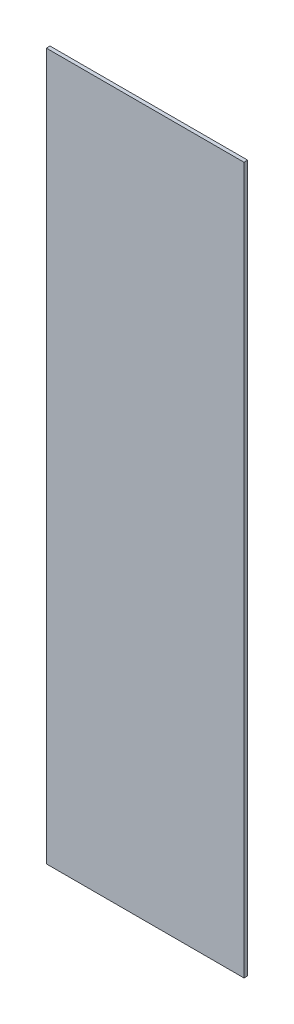
ISO-10303-21;
HEADER;
FILE_DESCRIPTION(('STEP AP214'),'2;1');
FILE_NAME('part.step','',(''),(''),'','','');
FILE_SCHEMA(('AUTOMOTIVE_DESIGN { 1 0 10303 214 1 1 1 1 }'));
ENDSEC;
DATA;
#1=APPLICATION_CONTEXT('core data for automotive mechanical design processes');
#2=APPLICATION_PROTOCOL_DEFINITION('international standard','automotive_design',2000,#1);
#3=PRODUCT_CONTEXT('',#1,'mechanical');
#4=PRODUCT('Part','Part','',(#3));
#5=PRODUCT_RELATED_PRODUCT_CATEGORY('part','',(#4));
#6=PRODUCT_DEFINITION_FORMATION('','',#4);
#7=PRODUCT_DEFINITION_CONTEXT('part definition',#1,'design');
#8=PRODUCT_DEFINITION('design','',#6,#7);
#9=PRODUCT_DEFINITION_SHAPE('','',#8);
#10=(LENGTH_UNIT() NAMED_UNIT(*) SI_UNIT(.MILLI.,.METRE.));
#11=(NAMED_UNIT(*) PLANE_ANGLE_UNIT() SI_UNIT($,.RADIAN.));
#12=(NAMED_UNIT(*) SI_UNIT($,.STERADIAN.) SOLID_ANGLE_UNIT());
#13=UNCERTAINTY_MEASURE_WITH_UNIT(LENGTH_MEASURE(1.E-05),#10,'distance_accuracy_value','');
#14=(GEOMETRIC_REPRESENTATION_CONTEXT(3) GLOBAL_UNCERTAINTY_ASSIGNED_CONTEXT((#13)) GLOBAL_UNIT_ASSIGNED_CONTEXT((#10,
#11,#12)) REPRESENTATION_CONTEXT('',''));
#15=CARTESIAN_POINT('',(0.,0.,0.));
#16=DIRECTION('',(0.,0.,1.));
#17=DIRECTION('',(1.,0.,0.));
#18=AXIS2_PLACEMENT_3D('',#15,#16,#17);
#19=CARTESIAN_POINT('',(0.,306.3875,0.));
#20=DIRECTION('',(1.,0.,0.));
#21=DIRECTION('',(0.,0.,-1.));
#22=AXIS2_PLACEMENT_3D('',#19,#20,#21);
#23=PLANE('',#22);
#24=DIRECTION('',(0.,0.,1.));
#25=VECTOR('',#24,1.);
#26=CARTESIAN_POINT('',(0.,-306.3875,0.));
#27=LINE('',#26,#25);
#28=CARTESIAN_POINT('',(0.,-306.3875,-3.175));
#29=VERTEX_POINT('',#28);
#30=CARTESIAN_POINT('',(0.,-306.3875,0.));
#31=VERTEX_POINT('',#30);
#32=EDGE_CURVE('E95',#29,#31,#27,.T.);
#33=ORIENTED_EDGE('',*,*,#32,.T.);
#34=DIRECTION('',(0.,-1.,0.));
#35=VECTOR('',#34,1.);
#36=CARTESIAN_POINT('',(0.,306.3875,0.));
#37=LINE('',#36,#35);
#38=CARTESIAN_POINT('',(0.,306.3875,0.));
#39=VERTEX_POINT('',#38);
#40=EDGE_CURVE('E11',#39,#31,#37,.T.);
#41=ORIENTED_EDGE('',*,*,#40,.F.);
#42=DIRECTION('',(0.,0.,1.));
#43=VECTOR('',#42,1.);
#44=CARTESIAN_POINT('',(0.,306.3875,0.));
#45=LINE('',#44,#43);
#46=CARTESIAN_POINT('',(0.,306.3875,-3.175));
#47=VERTEX_POINT('',#46);
#48=EDGE_CURVE('E83',#47,#39,#45,.T.);
#49=ORIENTED_EDGE('',*,*,#48,.F.);
#50=DIRECTION('',(0.,-1.,0.));
#51=VECTOR('',#50,1.);
#52=CARTESIAN_POINT('',(0.,306.3875,-3.175));
#53=LINE('',#52,#51);
#54=EDGE_CURVE('E91',#47,#29,#53,.T.);
#55=ORIENTED_EDGE('',*,*,#54,.T.);
#56=EDGE_LOOP('',(#33,#41,#49,#55));
#57=FACE_BOUND('',#56,.T.);
#58=ADVANCED_FACE('F32',(#57),#23,.F.);
#59=CARTESIAN_POINT('',(0.,306.3875,0.));
#60=DIRECTION('',(0.,0.,-1.));
#61=DIRECTION('',(-1.,0.,0.));
#62=AXIS2_PLACEMENT_3D('',#59,#60,#61);
#63=PLANE('',#62);
#64=DIRECTION('',(1.,0.,0.));
#65=VECTOR('',#64,1.);
#66=CARTESIAN_POINT('',(0.,-306.3875,0.));
#67=LINE('',#66,#65);
#68=CARTESIAN_POINT('',(171.45,-306.3875,0.));
#69=VERTEX_POINT('',#68);
#70=EDGE_CURVE('E87',#31,#69,#67,.T.);
#71=ORIENTED_EDGE('',*,*,#70,.T.);
#72=DIRECTION('',(0.,-1.,0.));
#73=VECTOR('',#72,1.);
#74=CARTESIAN_POINT('',(171.45,306.3875,0.));
#75=LINE('',#74,#73);
#76=CARTESIAN_POINT('',(171.45,306.3875,0.));
#77=VERTEX_POINT('',#76);
#78=EDGE_CURVE('E40',#77,#69,#75,.T.);
#79=ORIENTED_EDGE('',*,*,#78,.F.);
#80=DIRECTION('',(1.,0.,0.));
#81=VECTOR('',#80,1.);
#82=CARTESIAN_POINT('',(0.,306.3875,0.));
#83=LINE('',#82,#81);
#84=EDGE_CURVE('E78',#39,#77,#83,.T.);
#85=ORIENTED_EDGE('',*,*,#84,.F.);
#86=ORIENTED_EDGE('',*,*,#40,.T.);
#87=EDGE_LOOP('',(#71,#79,#85,#86));
#88=FACE_BOUND('',#87,.T.);
#89=ADVANCED_FACE('F86',(#88),#63,.F.);
#90=CARTESIAN_POINT('',(171.45,306.3875,0.));
#91=DIRECTION('',(-1.,0.,0.));
#92=DIRECTION('',(0.,0.,1.));
#93=AXIS2_PLACEMENT_3D('',#90,#91,#92);
#94=PLANE('',#93);
#95=DIRECTION('',(0.,0.,-1.));
#96=VECTOR('',#95,1.);
#97=CARTESIAN_POINT('',(171.45,-306.3875,0.));
#98=LINE('',#97,#96);
#99=CARTESIAN_POINT('',(171.45,-306.3875,-3.175));
#100=VERTEX_POINT('',#99);
#101=EDGE_CURVE('E65',#69,#100,#98,.T.);
#102=ORIENTED_EDGE('',*,*,#101,.T.);
#103=DIRECTION('',(0.,-1.,0.));
#104=VECTOR('',#103,1.);
#105=CARTESIAN_POINT('',(171.45,306.3875,-3.175));
#106=LINE('',#105,#104);
#107=CARTESIAN_POINT('',(171.45,306.3875,-3.175));
#108=VERTEX_POINT('',#107);
#109=EDGE_CURVE('E88',#108,#100,#106,.T.);
#110=ORIENTED_EDGE('',*,*,#109,.F.);
#111=DIRECTION('',(0.,0.,-1.));
#112=VECTOR('',#111,1.);
#113=CARTESIAN_POINT('',(171.45,306.3875,0.));
#114=LINE('',#113,#112);
#115=EDGE_CURVE('E81',#77,#108,#114,.T.);
#116=ORIENTED_EDGE('',*,*,#115,.F.);
#117=ORIENTED_EDGE('',*,*,#78,.T.);
#118=EDGE_LOOP('',(#102,#110,#116,#117));
#119=FACE_BOUND('',#118,.T.);
#120=ADVANCED_FACE('F89',(#119),#94,.F.);
#121=CARTESIAN_POINT('',(0.,306.3875,-3.175));
#122=DIRECTION('',(0.,0.,1.));
#123=DIRECTION('',(1.,0.,0.));
#124=AXIS2_PLACEMENT_3D('',#121,#122,#123);
#125=PLANE('',#124);
#126=DIRECTION('',(-1.,0.,0.));
#127=VECTOR('',#126,1.);
#128=CARTESIAN_POINT('',(0.,-306.3875,-3.175));
#129=LINE('',#128,#127);
#130=EDGE_CURVE('E71',#100,#29,#129,.T.);
#131=ORIENTED_EDGE('',*,*,#130,.T.);
#132=ORIENTED_EDGE('',*,*,#54,.F.);
#133=DIRECTION('',(-1.,0.,0.));
#134=VECTOR('',#133,1.);
#135=CARTESIAN_POINT('',(0.,306.3875,-3.175));
#136=LINE('',#135,#134);
#137=EDGE_CURVE('E48',#108,#47,#136,.T.);
#138=ORIENTED_EDGE('',*,*,#137,.F.);
#139=ORIENTED_EDGE('',*,*,#109,.T.);
#140=EDGE_LOOP('',(#131,#132,#138,#139));
#141=FACE_BOUND('',#140,.T.);
#142=ADVANCED_FACE('F102',(#141),#125,.F.);
#143=CARTESIAN_POINT('',(0.,306.3875,0.));
#144=DIRECTION('',(0.,-1.,0.));
#145=DIRECTION('',(0.,0.,-1.));
#146=AXIS2_PLACEMENT_3D('',#143,#144,#145);
#147=PLANE('',#146);
#148=ORIENTED_EDGE('',*,*,#48,.T.);
#149=ORIENTED_EDGE('',*,*,#84,.T.);
#150=ORIENTED_EDGE('',*,*,#115,.T.);
#151=ORIENTED_EDGE('',*,*,#137,.T.);
#152=EDGE_LOOP('',(#148,#149,#150,#151));
#153=FACE_BOUND('',#152,.T.);
#154=ADVANCED_FACE('F79',(#153),#147,.F.);
#155=CARTESIAN_POINT('',(0.,-306.3875,0.));
#156=DIRECTION('',(0.,-1.,0.));
#157=DIRECTION('',(0.,0.,-1.));
#158=AXIS2_PLACEMENT_3D('',#155,#156,#157);
#159=PLANE('',#158);
#160=ORIENTED_EDGE('',*,*,#32,.F.);
#161=ORIENTED_EDGE('',*,*,#130,.F.);
#162=ORIENTED_EDGE('',*,*,#101,.F.);
#163=ORIENTED_EDGE('',*,*,#70,.F.);
#164=EDGE_LOOP('',(#160,#161,#162,#163));
#165=FACE_BOUND('',#164,.T.);
#166=ADVANCED_FACE('F105',(#165),#159,.T.);
#167=CLOSED_SHELL('',(#58,#89,#120,#142,#154,#166));
#168=MANIFOLD_SOLID_BREP('B2',#167);
#169=ADVANCED_BREP_SHAPE_REPRESENTATION('',(#18,#168),#14);
#170=SHAPE_DEFINITION_REPRESENTATION(#9,#169);
ENDSEC;
END-ISO-10303-21;
